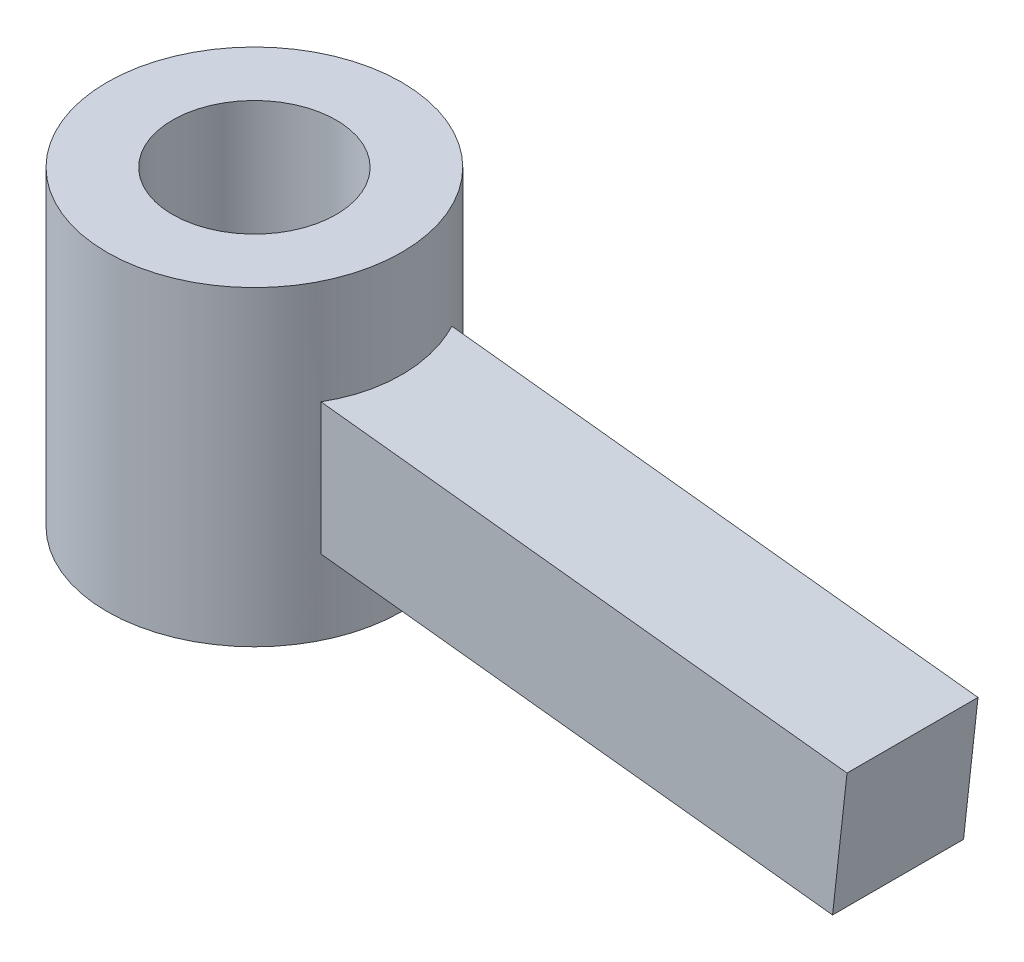
ISO-10303-21;
HEADER;
FILE_DESCRIPTION(('STEP AP214'),'2;1');
FILE_NAME('part.step','',(''),(''),'','','');
FILE_SCHEMA(('AUTOMOTIVE_DESIGN { 1 0 10303 214 1 1 1 1 }'));
ENDSEC;
DATA;
#1=APPLICATION_CONTEXT('core data for automotive mechanical design processes');
#2=APPLICATION_PROTOCOL_DEFINITION('international standard','automotive_design',2000,#1);
#3=PRODUCT_CONTEXT('',#1,'mechanical');
#4=PRODUCT('Part','Part','',(#3));
#5=PRODUCT_RELATED_PRODUCT_CATEGORY('part','',(#4));
#6=PRODUCT_DEFINITION_FORMATION('','',#4);
#7=PRODUCT_DEFINITION_CONTEXT('part definition',#1,'design');
#8=PRODUCT_DEFINITION('design','',#6,#7);
#9=PRODUCT_DEFINITION_SHAPE('','',#8);
#10=(LENGTH_UNIT() NAMED_UNIT(*) SI_UNIT(.MILLI.,.METRE.));
#11=(NAMED_UNIT(*) PLANE_ANGLE_UNIT() SI_UNIT($,.RADIAN.));
#12=(NAMED_UNIT(*) SI_UNIT($,.STERADIAN.) SOLID_ANGLE_UNIT());
#13=UNCERTAINTY_MEASURE_WITH_UNIT(LENGTH_MEASURE(1.E-05),#10,'distance_accuracy_value','');
#14=(GEOMETRIC_REPRESENTATION_CONTEXT(3) GLOBAL_UNCERTAINTY_ASSIGNED_CONTEXT((#13)) GLOBAL_UNIT_ASSIGNED_CONTEXT((#10,
#11,#12)) REPRESENTATION_CONTEXT('',''));
#15=CARTESIAN_POINT('',(0.,0.,0.));
#16=DIRECTION('',(0.,0.,1.));
#17=DIRECTION('',(1.,0.,0.));
#18=AXIS2_PLACEMENT_3D('',#15,#16,#17);
#19=CARTESIAN_POINT('',(0.,-6.0325,0.));
#20=DIRECTION('',(0.,1.,0.));
#21=DIRECTION('',(0.,0.,1.));
#22=AXIS2_PLACEMENT_3D('',#19,#20,#21);
#23=CYLINDRICAL_SURFACE('',#22,5.715);
#24=DIRECTION('',(0.,1.,0.));
#25=VECTOR('',#24,1.);
#26=CARTESIAN_POINT('',(5.11953367016958,-6.0325,2.54));
#27=LINE('',#26,#25);
#28=CARTESIAN_POINT('',(5.11953367016958,1.98681023654883,2.54));
#29=VERTEX_POINT('',#28);
#30=CARTESIAN_POINT('',(5.11953367016959,-3.12444969641408,2.54));
#31=VERTEX_POINT('',#30);
#32=EDGE_CURVE('E151',#29,#31,#27,.F.);
#33=ORIENTED_EDGE('',*,*,#32,.F.);
#34=CARTESIAN_POINT('',(0.,2.55562996648145,0.));
#35=DIRECTION('',(0.110428199945448,0.993884104237918,0.));
#36=DIRECTION('',(-0.993884104237918,0.110428199945448,0.));
#37=AXIS2_PLACEMENT_3D('',#34,#35,#36);
#38=ELLIPSE('',#37,5.75016742458327,5.715);
#39=CARTESIAN_POINT('',(5.11953367016958,1.98681023654883,-2.54));
#40=VERTEX_POINT('',#39);
#41=EDGE_CURVE('E104',#40,#29,#38,.F.);
#42=ORIENTED_EDGE('',*,*,#41,.F.);
#43=DIRECTION('',(0.,1.,0.));
#44=VECTOR('',#43,1.);
#45=CARTESIAN_POINT('',(5.11953367016958,-6.0325,-2.54));
#46=LINE('',#45,#44);
#47=CARTESIAN_POINT('',(5.11953367016958,-3.12444969641408,-2.54));
#48=VERTEX_POINT('',#47);
#49=EDGE_CURVE('E55',#48,#40,#46,.T.);
#50=ORIENTED_EDGE('',*,*,#49,.F.);
#51=CARTESIAN_POINT('',(0.,-2.55562996648145,0.));
#52=DIRECTION('',(-0.110428199945448,-0.993884104237918,0.));
#53=DIRECTION('',(-0.993884104237918,0.110428199945448,0.));
#54=AXIS2_PLACEMENT_3D('',#51,#52,#53);
#55=ELLIPSE('',#54,5.75016742458327,5.715);
#56=EDGE_CURVE('E50',#31,#48,#55,.F.);
#57=ORIENTED_EDGE('',*,*,#56,.F.);
#58=EDGE_LOOP('',(#33,#42,#50,#57));
#59=FACE_BOUND('',#58,.T.);
#60=CARTESIAN_POINT('',(0.,-6.0325,0.));
#61=DIRECTION('',(0.,1.,0.));
#62=DIRECTION('',(0.,0.,1.));
#63=AXIS2_PLACEMENT_3D('',#60,#61,#62);
#64=CIRCLE('',#63,5.715);
#65=CARTESIAN_POINT('',(0.,-6.0325,5.715));
#66=VERTEX_POINT('',#65);
#67=EDGE_CURVE('E162',#66,#66,#64,.T.);
#68=ORIENTED_EDGE('',*,*,#67,.T.);
#69=EDGE_LOOP('',(#68));
#70=FACE_BOUND('',#69,.T.);
#71=CARTESIAN_POINT('',(0.,6.0325,0.));
#72=DIRECTION('',(0.,1.,0.));
#73=DIRECTION('',(0.,0.,1.));
#74=AXIS2_PLACEMENT_3D('',#71,#72,#73);
#75=CIRCLE('',#74,5.715);
#76=CARTESIAN_POINT('',(0.,6.0325,5.715));
#77=VERTEX_POINT('',#76);
#78=EDGE_CURVE('E156',#77,#77,#75,.T.);
#79=ORIENTED_EDGE('',*,*,#78,.F.);
#80=EDGE_LOOP('',(#79));
#81=FACE_BOUND('',#80,.T.);
#82=ADVANCED_FACE('F35',(#59,#70,#81),#23,.T.);
#83=CARTESIAN_POINT('',(0.,-6.0325,0.));
#84=DIRECTION('',(0.,1.,0.));
#85=DIRECTION('',(0.,0.,1.));
#86=AXIS2_PLACEMENT_3D('',#83,#84,#85);
#87=PLANE('',#86);
#88=CARTESIAN_POINT('',(0.,-6.0325,0.));
#89=DIRECTION('',(0.,1.,0.));
#90=DIRECTION('',(0.,0.,1.));
#91=AXIS2_PLACEMENT_3D('',#88,#89,#90);
#92=CIRCLE('',#91,3.175);
#93=CARTESIAN_POINT('',(0.,-6.0325,3.175));
#94=VERTEX_POINT('',#93);
#95=EDGE_CURVE('E159',#94,#94,#92,.T.);
#96=ORIENTED_EDGE('',*,*,#95,.T.);
#97=EDGE_LOOP('',(#96));
#98=FACE_BOUND('',#97,.T.);
#99=ORIENTED_EDGE('',*,*,#67,.F.);
#100=EDGE_LOOP('',(#99));
#101=FACE_BOUND('',#100,.T.);
#102=ADVANCED_FACE('F203',(#98,#101),#87,.F.);
#103=CARTESIAN_POINT('',(0.,6.0325,0.));
#104=DIRECTION('',(0.,1.,0.));
#105=DIRECTION('',(0.,0.,1.));
#106=AXIS2_PLACEMENT_3D('',#103,#104,#105);
#107=PLANE('',#106);
#108=ORIENTED_EDGE('',*,*,#78,.T.);
#109=EDGE_LOOP('',(#108));
#110=FACE_BOUND('',#109,.T.);
#111=CARTESIAN_POINT('',(0.,6.0325,0.));
#112=DIRECTION('',(0.,1.,0.));
#113=DIRECTION('',(0.,0.,1.));
#114=AXIS2_PLACEMENT_3D('',#111,#112,#113);
#115=CIRCLE('',#114,3.175);
#116=CARTESIAN_POINT('',(0.,6.0325,3.175));
#117=VERTEX_POINT('',#116);
#118=EDGE_CURVE('E153',#117,#117,#115,.T.);
#119=ORIENTED_EDGE('',*,*,#118,.F.);
#120=EDGE_LOOP('',(#119));
#121=FACE_BOUND('',#120,.T.);
#122=ADVANCED_FACE('F207',(#110,#121),#107,.T.);
#123=CARTESIAN_POINT('',(0.,-5.715,0.));
#124=DIRECTION('',(0.,1.,0.));
#125=DIRECTION('',(0.,0.,1.));
#126=AXIS2_PLACEMENT_3D('',#123,#124,#125);
#127=CYLINDRICAL_SURFACE('',#126,3.175);
#128=CARTESIAN_POINT('',(0.,2.55562996648145,0.));
#129=DIRECTION('',(0.110428199945448,0.993884104237918,0.));
#130=DIRECTION('',(-0.993884104237918,0.110428199945448,0.));
#131=AXIS2_PLACEMENT_3D('',#128,#129,#130);
#132=ELLIPSE('',#131,3.19453745810182,3.175);
#133=CARTESIAN_POINT('',(1.90500000000001,2.34396975378756,-2.54));
#134=VERTEX_POINT('',#133);
#135=CARTESIAN_POINT('',(1.905,2.34396975378756,2.54));
#136=VERTEX_POINT('',#135);
#137=EDGE_CURVE('E165',#134,#136,#132,.F.);
#138=ORIENTED_EDGE('',*,*,#137,.T.);
#139=DIRECTION('',(0.,1.,0.));
#140=VECTOR('',#139,1.);
#141=CARTESIAN_POINT('',(1.905,-5.715,2.54));
#142=LINE('',#141,#140);
#143=CARTESIAN_POINT('',(1.90500000000001,-2.76729017917535,2.54));
#144=VERTEX_POINT('',#143);
#145=EDGE_CURVE('E11',#136,#144,#142,.F.);
#146=ORIENTED_EDGE('',*,*,#145,.T.);
#147=CARTESIAN_POINT('',(0.,-2.55562996648145,0.));
#148=DIRECTION('',(-0.110428199945448,-0.993884104237918,0.));
#149=DIRECTION('',(-0.993884104237918,0.110428199945448,0.));
#150=AXIS2_PLACEMENT_3D('',#147,#148,#149);
#151=ELLIPSE('',#150,3.19453745810182,3.175);
#152=CARTESIAN_POINT('',(1.905,-2.76729017917535,-2.54));
#153=VERTEX_POINT('',#152);
#154=EDGE_CURVE('E43',#144,#153,#151,.F.);
#155=ORIENTED_EDGE('',*,*,#154,.T.);
#156=DIRECTION('',(0.,1.,0.));
#157=VECTOR('',#156,1.);
#158=CARTESIAN_POINT('',(1.905,-5.715,-2.54));
#159=LINE('',#158,#157);
#160=EDGE_CURVE('E168',#153,#134,#159,.T.);
#161=ORIENTED_EDGE('',*,*,#160,.T.);
#162=EDGE_LOOP('',(#138,#146,#155,#161));
#163=FACE_BOUND('',#162,.T.);
#164=ORIENTED_EDGE('',*,*,#95,.F.);
#165=EDGE_LOOP('',(#164));
#166=FACE_BOUND('',#165,.T.);
#167=ORIENTED_EDGE('',*,*,#118,.T.);
#168=EDGE_LOOP('',(#167));
#169=FACE_BOUND('',#168,.T.);
#170=ADVANCED_FACE('F37',(#163,#166,#169),#127,.F.);
#171=CARTESIAN_POINT('',(0.,0.,0.));
#172=DIRECTION('',(0.993884104237918,-0.110428199945448,0.));
#173=DIRECTION('',(0.110428199945448,0.993884104237918,0.));
#174=AXIS2_PLACEMENT_3D('',#171,#172,#173);
#175=PLANE('',#174);
#176=DIRECTION('',(0.110428199945448,0.993884104237918,0.));
#177=VECTOR('',#176,1.);
#178=CARTESIAN_POINT('',(-0.280487627861438,-2.52446562476431,2.54));
#179=LINE('',#178,#177);
#180=CARTESIAN_POINT('',(-0.280487627861438,-2.52446562476431,2.54));
#181=VERTEX_POINT('',#180);
#182=CARTESIAN_POINT('',(0.280487627861438,2.52446562476431,2.54));
#183=VERTEX_POINT('',#182);
#184=EDGE_CURVE('E132',#181,#183,#179,.T.);
#185=ORIENTED_EDGE('',*,*,#184,.T.);
#186=DIRECTION('',(0.,0.,-1.));
#187=VECTOR('',#186,1.);
#188=CARTESIAN_POINT('',(0.280487627861438,2.52446562476431,-2.54));
#189=LINE('',#188,#187);
#190=CARTESIAN_POINT('',(0.280487627861438,2.52446562476431,-2.54));
#191=VERTEX_POINT('',#190);
#192=EDGE_CURVE('E135',#183,#191,#189,.T.);
#193=ORIENTED_EDGE('',*,*,#192,.T.);
#194=DIRECTION('',(-0.110428199945448,-0.993884104237918,0.));
#195=VECTOR('',#194,1.);
#196=CARTESIAN_POINT('',(-0.280487627861438,-2.52446562476431,-2.54));
#197=LINE('',#196,#195);
#198=CARTESIAN_POINT('',(-0.280487627861438,-2.52446562476431,-2.54));
#199=VERTEX_POINT('',#198);
#200=EDGE_CURVE('E126',#191,#199,#197,.T.);
#201=ORIENTED_EDGE('',*,*,#200,.T.);
#202=DIRECTION('',(0.,0.,1.));
#203=VECTOR('',#202,1.);
#204=CARTESIAN_POINT('',(-0.280487627861438,-2.52446562476431,-2.54));
#205=LINE('',#204,#203);
#206=EDGE_CURVE('E123',#199,#181,#205,.T.);
#207=ORIENTED_EDGE('',*,*,#206,.T.);
#208=EDGE_LOOP('',(#185,#193,#201,#207));
#209=FACE_BOUND('',#208,.T.);
#210=ADVANCED_FACE('F184',(#209),#175,.F.);
#211=CARTESIAN_POINT('',(25.5251438755045,-0.280410653850066,-2.54));
#212=DIRECTION('',(0.110428199945448,0.993884104237918,0.));
#213=DIRECTION('',(-0.993884104237918,0.110428199945448,0.));
#214=AXIS2_PLACEMENT_3D('',#211,#212,#213);
#215=PLANE('',#214);
#216=ORIENTED_EDGE('',*,*,#137,.F.);
#217=DIRECTION('',(-0.993884104237918,0.110428199945448,0.));
#218=VECTOR('',#217,1.);
#219=CARTESIAN_POINT('',(25.5251438755045,-0.280410653850066,-2.54));
#220=LINE('',#219,#218);
#221=EDGE_CURVE('E107',#134,#191,#220,.T.);
#222=ORIENTED_EDGE('',*,*,#221,.T.);
#223=ORIENTED_EDGE('',*,*,#192,.F.);
#224=DIRECTION('',(-0.993884104237918,0.110428199945448,0.));
#225=VECTOR('',#224,1.);
#226=CARTESIAN_POINT('',(25.5251438755045,-0.280410653850066,2.54));
#227=LINE('',#226,#225);
#228=EDGE_CURVE('E108',#136,#183,#227,.T.);
#229=ORIENTED_EDGE('',*,*,#228,.F.);
#230=EDGE_LOOP('',(#216,#222,#223,#229));
#231=FACE_BOUND('',#230,.T.);
#232=ADVANCED_FACE('F190',(#231),#215,.T.);
#233=CARTESIAN_POINT('',(24.9641686197817,-5.32934190337869,-2.54));
#234=DIRECTION('',(0.,0.,-1.));
#235=DIRECTION('',(0.,1.,0.));
#236=AXIS2_PLACEMENT_3D('',#233,#234,#235);
#237=PLANE('',#236);
#238=ORIENTED_EDGE('',*,*,#160,.F.);
#239=DIRECTION('',(-0.993884104237918,0.110428199945448,0.));
#240=VECTOR('',#239,1.);
#241=CARTESIAN_POINT('',(24.9641686197817,-5.32934190337869,-2.54));
#242=LINE('',#241,#240);
#243=EDGE_CURVE('E145',#153,#199,#242,.T.);
#244=ORIENTED_EDGE('',*,*,#243,.T.);
#245=ORIENTED_EDGE('',*,*,#200,.F.);
#246=ORIENTED_EDGE('',*,*,#221,.F.);
#247=EDGE_LOOP('',(#238,#244,#245,#246));
#248=FACE_BOUND('',#247,.T.);
#249=ADVANCED_FACE('F188',(#248),#237,.T.);
#250=CARTESIAN_POINT('',(24.9641686197817,-5.32934190337869,-2.54));
#251=DIRECTION('',(-0.110428199945448,-0.993884104237918,0.));
#252=DIRECTION('',(0.993884104237918,-0.110428199945448,0.));
#253=AXIS2_PLACEMENT_3D('',#250,#251,#252);
#254=PLANE('',#253);
#255=ORIENTED_EDGE('',*,*,#154,.F.);
#256=DIRECTION('',(-0.993884104237918,0.110428199945448,0.));
#257=VECTOR('',#256,1.);
#258=CARTESIAN_POINT('',(24.9641686197817,-5.32934190337869,2.54));
#259=LINE('',#258,#257);
#260=EDGE_CURVE('E141',#144,#181,#259,.T.);
#261=ORIENTED_EDGE('',*,*,#260,.T.);
#262=ORIENTED_EDGE('',*,*,#206,.F.);
#263=ORIENTED_EDGE('',*,*,#243,.F.);
#264=EDGE_LOOP('',(#255,#261,#262,#263));
#265=FACE_BOUND('',#264,.T.);
#266=ADVANCED_FACE('F177',(#265),#254,.T.);
#267=CARTESIAN_POINT('',(24.9641686197817,-5.32934190337869,2.54));
#268=DIRECTION('',(0.,0.,1.));
#269=DIRECTION('',(0.,-1.,0.));
#270=AXIS2_PLACEMENT_3D('',#267,#268,#269);
#271=PLANE('',#270);
#272=ORIENTED_EDGE('',*,*,#145,.F.);
#273=ORIENTED_EDGE('',*,*,#228,.T.);
#274=ORIENTED_EDGE('',*,*,#184,.F.);
#275=ORIENTED_EDGE('',*,*,#260,.F.);
#276=EDGE_LOOP('',(#272,#273,#274,#275));
#277=FACE_BOUND('',#276,.T.);
#278=ADVANCED_FACE('F181',(#277),#271,.T.);
#279=CARTESIAN_POINT('',(25.5251438755045,-0.280410653850066,2.54));
#280=VERTEX_POINT('',#279);
#281=EDGE_CURVE('E99',#280,#29,#227,.T.);
#282=ORIENTED_EDGE('',*,*,#281,.T.);
#283=ORIENTED_EDGE('',*,*,#32,.T.);
#284=CARTESIAN_POINT('',(24.9641686197817,-5.32934190337869,2.54));
#285=VERTEX_POINT('',#284);
#286=EDGE_CURVE('E122',#285,#31,#259,.T.);
#287=ORIENTED_EDGE('',*,*,#286,.F.);
#288=DIRECTION('',(0.110428199945448,0.993884104237918,0.));
#289=VECTOR('',#288,1.);
#290=CARTESIAN_POINT('',(24.9641686197817,-5.32934190337869,2.54));
#291=LINE('',#290,#289);
#292=EDGE_CURVE('E115',#285,#280,#291,.T.);
#293=ORIENTED_EDGE('',*,*,#292,.T.);
#294=EDGE_LOOP('',(#282,#283,#287,#293));
#295=FACE_BOUND('',#294,.T.);
#296=ADVANCED_FACE('F120',(#295),#271,.T.);
#297=ORIENTED_EDGE('',*,*,#286,.T.);
#298=ORIENTED_EDGE('',*,*,#56,.T.);
#299=CARTESIAN_POINT('',(24.9641686197817,-5.32934190337869,-2.54));
#300=VERTEX_POINT('',#299);
#301=EDGE_CURVE('E142',#300,#48,#242,.T.);
#302=ORIENTED_EDGE('',*,*,#301,.F.);
#303=DIRECTION('',(0.,0.,1.));
#304=VECTOR('',#303,1.);
#305=CARTESIAN_POINT('',(24.9641686197817,-5.32934190337869,-2.54));
#306=LINE('',#305,#304);
#307=EDGE_CURVE('E130',#300,#285,#306,.T.);
#308=ORIENTED_EDGE('',*,*,#307,.T.);
#309=EDGE_LOOP('',(#297,#298,#302,#308));
#310=FACE_BOUND('',#309,.T.);
#311=ADVANCED_FACE('F215',(#310),#254,.T.);
#312=ORIENTED_EDGE('',*,*,#301,.T.);
#313=ORIENTED_EDGE('',*,*,#49,.T.);
#314=CARTESIAN_POINT('',(25.5251438755045,-0.280410653850066,-2.54));
#315=VERTEX_POINT('',#314);
#316=EDGE_CURVE('E146',#315,#40,#220,.T.);
#317=ORIENTED_EDGE('',*,*,#316,.F.);
#318=DIRECTION('',(-0.110428199945448,-0.993884104237918,0.));
#319=VECTOR('',#318,1.);
#320=CARTESIAN_POINT('',(24.9641686197817,-5.32934190337869,-2.54));
#321=LINE('',#320,#319);
#322=EDGE_CURVE('E118',#315,#300,#321,.T.);
#323=ORIENTED_EDGE('',*,*,#322,.T.);
#324=EDGE_LOOP('',(#312,#313,#317,#323));
#325=FACE_BOUND('',#324,.T.);
#326=ADVANCED_FACE('F198',(#325),#237,.T.);
#327=ORIENTED_EDGE('',*,*,#316,.T.);
#328=ORIENTED_EDGE('',*,*,#41,.T.);
#329=ORIENTED_EDGE('',*,*,#281,.F.);
#330=DIRECTION('',(0.,0.,-1.));
#331=VECTOR('',#330,1.);
#332=CARTESIAN_POINT('',(25.5251438755045,-0.280410653850066,-2.54));
#333=LINE('',#332,#331);
#334=EDGE_CURVE('E103',#280,#315,#333,.T.);
#335=ORIENTED_EDGE('',*,*,#334,.T.);
#336=EDGE_LOOP('',(#327,#328,#329,#335));
#337=FACE_BOUND('',#336,.T.);
#338=ADVANCED_FACE('F102',(#337),#215,.T.);
#339=CARTESIAN_POINT('',(25.2446562476431,-2.80487627861438,0.));
#340=DIRECTION('',(0.993884104237918,-0.110428199945448,0.));
#341=DIRECTION('',(0.110428199945448,0.993884104237918,0.));
#342=AXIS2_PLACEMENT_3D('',#339,#340,#341);
#343=PLANE('',#342);
#344=ORIENTED_EDGE('',*,*,#292,.F.);
#345=ORIENTED_EDGE('',*,*,#307,.F.);
#346=ORIENTED_EDGE('',*,*,#322,.F.);
#347=ORIENTED_EDGE('',*,*,#334,.F.);
#348=EDGE_LOOP('',(#344,#345,#346,#347));
#349=FACE_BOUND('',#348,.T.);
#350=ADVANCED_FACE('F113',(#349),#343,.T.);
#351=CLOSED_SHELL('',(#82,#102,#122,#170,#210,#232,#249,#266,#278,#296,#311,#326,#338,#350));
#352=MANIFOLD_SOLID_BREP('B2',#351);
#353=ADVANCED_BREP_SHAPE_REPRESENTATION('',(#18,#352),#14);
#354=SHAPE_DEFINITION_REPRESENTATION(#9,#353);
ENDSEC;
END-ISO-10303-21;
